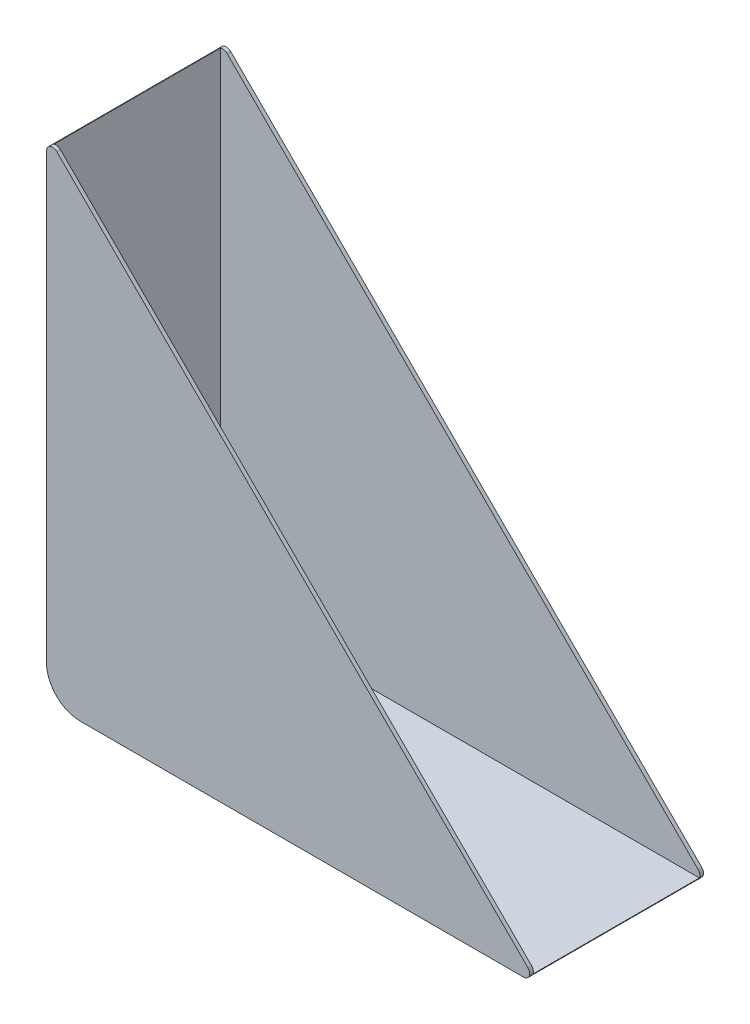
ISO-10303-21;
HEADER;
FILE_DESCRIPTION(('STEP AP214'),'2;1');
FILE_NAME('part.step','',(''),(''),'','','');
FILE_SCHEMA(('AUTOMOTIVE_DESIGN { 1 0 10303 214 1 1 1 1 }'));
ENDSEC;
DATA;
#1=APPLICATION_CONTEXT('core data for automotive mechanical design processes');
#2=APPLICATION_PROTOCOL_DEFINITION('international standard','automotive_design',2000,#1);
#3=PRODUCT_CONTEXT('',#1,'mechanical');
#4=PRODUCT('Part','Part','',(#3));
#5=PRODUCT_RELATED_PRODUCT_CATEGORY('part','',(#4));
#6=PRODUCT_DEFINITION_FORMATION('','',#4);
#7=PRODUCT_DEFINITION_CONTEXT('part definition',#1,'design');
#8=PRODUCT_DEFINITION('design','',#6,#7);
#9=PRODUCT_DEFINITION_SHAPE('','',#8);
#10=(LENGTH_UNIT() NAMED_UNIT(*) SI_UNIT(.MILLI.,.METRE.));
#11=(NAMED_UNIT(*) PLANE_ANGLE_UNIT() SI_UNIT($,.RADIAN.));
#12=(NAMED_UNIT(*) SI_UNIT($,.STERADIAN.) SOLID_ANGLE_UNIT());
#13=UNCERTAINTY_MEASURE_WITH_UNIT(LENGTH_MEASURE(1.E-05),#10,'distance_accuracy_value','');
#14=(GEOMETRIC_REPRESENTATION_CONTEXT(3) GLOBAL_UNCERTAINTY_ASSIGNED_CONTEXT((#13)) GLOBAL_UNIT_ASSIGNED_CONTEXT((#10,
#11,#12)) REPRESENTATION_CONTEXT('',''));
#15=CARTESIAN_POINT('',(0.,0.,0.));
#16=DIRECTION('',(0.,0.,1.));
#17=DIRECTION('',(1.,0.,0.));
#18=AXIS2_PLACEMENT_3D('',#15,#16,#17);
#19=CARTESIAN_POINT('',(0.,160.,27.5));
#20=DIRECTION('',(-0.707106781186548,-0.707106781186548,0.));
#21=DIRECTION('',(0.707106781186548,-0.707106781186548,0.));
#22=AXIS2_PLACEMENT_3D('',#19,#20,#21);
#23=PLANE('',#22);
#24=DIRECTION('',(-0.707106781186548,0.707106781186548,0.));
#25=VECTOR('',#24,1.);
#26=CARTESIAN_POINT('',(80.,80.,28.7));
#27=LINE('',#26,#25);
#28=CARTESIAN_POINT('',(157.785786437627,2.2142135623731,28.7));
#29=VERTEX_POINT('',#28);
#30=CARTESIAN_POINT('',(2.21421356237307,157.785786437627,28.7));
#31=VERTEX_POINT('',#30);
#32=EDGE_CURVE('E166',#29,#31,#27,.T.);
#33=ORIENTED_EDGE('',*,*,#32,.F.);
#34=DIRECTION('',(0.,0.,-1.));
#35=VECTOR('',#34,1.);
#36=CARTESIAN_POINT('',(157.785786437627,2.21421356237314,27.5));
#37=LINE('',#36,#35);
#38=CARTESIAN_POINT('',(157.785786437627,2.21421356237314,27.5));
#39=VERTEX_POINT('',#38);
#40=EDGE_CURVE('E193',#29,#39,#37,.T.);
#41=ORIENTED_EDGE('',*,*,#40,.T.);
#42=DIRECTION('',(-0.707106781186548,0.707106781186548,0.));
#43=VECTOR('',#42,1.);
#44=CARTESIAN_POINT('',(0.,160.,27.5));
#45=LINE('',#44,#43);
#46=CARTESIAN_POINT('',(2.21421356237309,157.785786437627,27.5));
#47=VERTEX_POINT('',#46);
#48=EDGE_CURVE('E240',#39,#47,#45,.T.);
#49=ORIENTED_EDGE('',*,*,#48,.T.);
#50=DIRECTION('',(0.,0.,-1.));
#51=VECTOR('',#50,1.);
#52=CARTESIAN_POINT('',(2.21421356237309,157.785786437627,27.5));
#53=LINE('',#52,#51);
#54=EDGE_CURVE('E178',#47,#31,#53,.F.);
#55=ORIENTED_EDGE('',*,*,#54,.T.);
#56=EDGE_LOOP('',(#33,#41,#49,#55));
#57=FACE_BOUND('',#56,.T.);
#58=ADVANCED_FACE('F35',(#57),#23,.F.);
#59=DIRECTION('',(-0.707106781186548,0.707106781186548,0.));
#60=VECTOR('',#59,1.);
#61=CARTESIAN_POINT('',(0.,160.,-27.5));
#62=LINE('',#61,#60);
#63=CARTESIAN_POINT('',(157.785786437627,2.21421356237308,-27.5));
#64=VERTEX_POINT('',#63);
#65=CARTESIAN_POINT('',(2.21421356237309,157.785786437627,-27.5));
#66=VERTEX_POINT('',#65);
#67=EDGE_CURVE('E152',#64,#66,#62,.T.);
#68=ORIENTED_EDGE('',*,*,#67,.F.);
#69=DIRECTION('',(0.,0.,-1.));
#70=VECTOR('',#69,1.);
#71=CARTESIAN_POINT('',(157.785786437627,2.21421356237314,27.5));
#72=LINE('',#71,#70);
#73=CARTESIAN_POINT('',(157.785786437627,2.2142135623731,-28.7));
#74=VERTEX_POINT('',#73);
#75=EDGE_CURVE('E191',#64,#74,#72,.T.);
#76=ORIENTED_EDGE('',*,*,#75,.T.);
#77=DIRECTION('',(-0.707106781186548,0.707106781186548,0.));
#78=VECTOR('',#77,1.);
#79=CARTESIAN_POINT('',(80.,80.,-28.7));
#80=LINE('',#79,#78);
#81=CARTESIAN_POINT('',(2.21421356237307,157.785786437627,-28.7));
#82=VERTEX_POINT('',#81);
#83=EDGE_CURVE('E174',#74,#82,#80,.T.);
#84=ORIENTED_EDGE('',*,*,#83,.T.);
#85=DIRECTION('',(0.,0.,-1.));
#86=VECTOR('',#85,1.);
#87=CARTESIAN_POINT('',(2.21421356237309,157.785786437627,27.5));
#88=LINE('',#87,#86);
#89=EDGE_CURVE('E189',#82,#66,#88,.F.);
#90=ORIENTED_EDGE('',*,*,#89,.T.);
#91=EDGE_LOOP('',(#68,#76,#84,#90));
#92=FACE_BOUND('',#91,.T.);
#93=ADVANCED_FACE('F251',(#92),#23,.F.);
#94=CARTESIAN_POINT('',(160.,-1.19999999999999,27.5));
#95=DIRECTION('',(0.,1.,0.));
#96=DIRECTION('',(-1.,0.,0.));
#97=AXIS2_PLACEMENT_3D('',#94,#95,#96);
#98=PLANE('',#97);
#99=DIRECTION('',(1.,0.,0.));
#100=VECTOR('',#99,1.);
#101=CARTESIAN_POINT('',(0.,-1.2,-28.7));
#102=LINE('',#101,#100);
#103=CARTESIAN_POINT('',(10.,-1.2,-28.7));
#104=VERTEX_POINT('',#103);
#105=CARTESIAN_POINT('',(156.371572875254,-1.19999999999999,-28.7));
#106=VERTEX_POINT('',#105);
#107=EDGE_CURVE('E163',#104,#106,#102,.T.);
#108=ORIENTED_EDGE('',*,*,#107,.T.);
#109=DIRECTION('',(0.,0.,-1.));
#110=VECTOR('',#109,1.);
#111=CARTESIAN_POINT('',(156.371572875254,-1.19999999999999,27.5));
#112=LINE('',#111,#110);
#113=CARTESIAN_POINT('',(156.371572875254,-1.19999999999999,28.7));
#114=VERTEX_POINT('',#113);
#115=EDGE_CURVE('E58',#106,#114,#112,.F.);
#116=ORIENTED_EDGE('',*,*,#115,.T.);
#117=DIRECTION('',(1.,0.,0.));
#118=VECTOR('',#117,1.);
#119=CARTESIAN_POINT('',(0.,-1.2,28.7));
#120=LINE('',#119,#118);
#121=CARTESIAN_POINT('',(10.,-1.2,28.7));
#122=VERTEX_POINT('',#121);
#123=EDGE_CURVE('E164',#122,#114,#120,.T.);
#124=ORIENTED_EDGE('',*,*,#123,.F.);
#125=DIRECTION('',(0.,0.,1.));
#126=VECTOR('',#125,1.);
#127=CARTESIAN_POINT('',(10.,-1.2,27.5));
#128=LINE('',#127,#126);
#129=EDGE_CURVE('E168',#122,#104,#128,.F.);
#130=ORIENTED_EDGE('',*,*,#129,.T.);
#131=EDGE_LOOP('',(#108,#116,#124,#130));
#132=FACE_BOUND('',#131,.T.);
#133=ADVANCED_FACE('F229',(#132),#98,.F.);
#134=CARTESIAN_POINT('',(-1.2,0.,27.5));
#135=DIRECTION('',(1.,0.,0.));
#136=DIRECTION('',(0.,0.,-1.));
#137=AXIS2_PLACEMENT_3D('',#134,#135,#136);
#138=PLANE('',#137);
#139=DIRECTION('',(0.,-1.,0.));
#140=VECTOR('',#139,1.);
#141=CARTESIAN_POINT('',(-1.2,0.,28.7));
#142=LINE('',#141,#140);
#143=CARTESIAN_POINT('',(-1.2,156.371572875254,28.7));
#144=VERTEX_POINT('',#143);
#145=CARTESIAN_POINT('',(-1.2,10.,28.7));
#146=VERTEX_POINT('',#145);
#147=EDGE_CURVE('E172',#144,#146,#142,.T.);
#148=ORIENTED_EDGE('',*,*,#147,.F.);
#149=DIRECTION('',(0.,0.,-1.));
#150=VECTOR('',#149,1.);
#151=CARTESIAN_POINT('',(-1.2,156.371572875254,27.5));
#152=LINE('',#151,#150);
#153=CARTESIAN_POINT('',(-1.2,156.371572875254,-28.7));
#154=VERTEX_POINT('',#153);
#155=EDGE_CURVE('E43',#144,#154,#152,.T.);
#156=ORIENTED_EDGE('',*,*,#155,.T.);
#157=DIRECTION('',(0.,-1.,0.));
#158=VECTOR('',#157,1.);
#159=CARTESIAN_POINT('',(-1.2,0.,-28.7));
#160=LINE('',#159,#158);
#161=CARTESIAN_POINT('',(-1.2,10.,-28.7));
#162=VERTEX_POINT('',#161);
#163=EDGE_CURVE('E167',#154,#162,#160,.T.);
#164=ORIENTED_EDGE('',*,*,#163,.T.);
#165=DIRECTION('',(0.,0.,-1.));
#166=VECTOR('',#165,1.);
#167=CARTESIAN_POINT('',(-1.2,10.,27.5));
#168=LINE('',#167,#166);
#169=EDGE_CURVE('E179',#162,#146,#168,.F.);
#170=ORIENTED_EDGE('',*,*,#169,.T.);
#171=EDGE_LOOP('',(#148,#156,#164,#170));
#172=FACE_BOUND('',#171,.T.);
#173=ADVANCED_FACE('F216',(#172),#138,.F.);
#174=CARTESIAN_POINT('',(0.,0.,28.7));
#175=DIRECTION('',(0.,0.,-1.));
#176=DIRECTION('',(-1.,0.,0.));
#177=AXIS2_PLACEMENT_3D('',#174,#175,#176);
#178=PLANE('',#177);
#179=ORIENTED_EDGE('',*,*,#123,.T.);
#180=CARTESIAN_POINT('',(156.371572875254,0.800000000000023,28.7));
#181=DIRECTION('',(0.,0.,-1.));
#182=DIRECTION('',(-1.,0.,0.));
#183=AXIS2_PLACEMENT_3D('',#180,#181,#182);
#184=CIRCLE('',#183,2.);
#185=EDGE_CURVE('E211',#114,#29,#184,.F.);
#186=ORIENTED_EDGE('',*,*,#185,.T.);
#187=ORIENTED_EDGE('',*,*,#32,.T.);
#188=CARTESIAN_POINT('',(0.8,156.371572875254,28.7));
#189=DIRECTION('',(0.,0.,-1.));
#190=DIRECTION('',(-1.,0.,0.));
#191=AXIS2_PLACEMENT_3D('',#188,#189,#190);
#192=CIRCLE('',#191,2.);
#193=EDGE_CURVE('E50',#31,#144,#192,.F.);
#194=ORIENTED_EDGE('',*,*,#193,.T.);
#195=ORIENTED_EDGE('',*,*,#147,.T.);
#196=CARTESIAN_POINT('',(10.,10.,28.7));
#197=DIRECTION('',(0.,0.,-1.));
#198=DIRECTION('',(-1.,0.,0.));
#199=AXIS2_PLACEMENT_3D('',#196,#197,#198);
#200=CIRCLE('',#199,11.2);
#201=EDGE_CURVE('E176',#146,#122,#200,.F.);
#202=ORIENTED_EDGE('',*,*,#201,.T.);
#203=EDGE_LOOP('',(#179,#186,#187,#194,#195,#202));
#204=FACE_BOUND('',#203,.T.);
#205=ADVANCED_FACE('F227',(#204),#178,.F.);
#206=CARTESIAN_POINT('',(0.,0.,-28.7));
#207=DIRECTION('',(0.,0.,-1.));
#208=DIRECTION('',(-1.,0.,0.));
#209=AXIS2_PLACEMENT_3D('',#206,#207,#208);
#210=PLANE('',#209);
#211=ORIENTED_EDGE('',*,*,#83,.F.);
#212=CARTESIAN_POINT('',(156.371572875254,0.800000000000023,-28.7));
#213=DIRECTION('',(0.,0.,-1.));
#214=DIRECTION('',(-1.,0.,0.));
#215=AXIS2_PLACEMENT_3D('',#212,#213,#214);
#216=CIRCLE('',#215,2.);
#217=EDGE_CURVE('E207',#74,#106,#216,.T.);
#218=ORIENTED_EDGE('',*,*,#217,.T.);
#219=ORIENTED_EDGE('',*,*,#107,.F.);
#220=CARTESIAN_POINT('',(10.,10.,-28.7));
#221=DIRECTION('',(0.,0.,-1.));
#222=DIRECTION('',(-1.,0.,0.));
#223=AXIS2_PLACEMENT_3D('',#220,#221,#222);
#224=CIRCLE('',#223,11.2);
#225=EDGE_CURVE('E171',#104,#162,#224,.T.);
#226=ORIENTED_EDGE('',*,*,#225,.T.);
#227=ORIENTED_EDGE('',*,*,#163,.F.);
#228=CARTESIAN_POINT('',(0.8,156.371572875254,-28.7));
#229=DIRECTION('',(0.,0.,-1.));
#230=DIRECTION('',(-1.,0.,0.));
#231=AXIS2_PLACEMENT_3D('',#228,#229,#230);
#232=CIRCLE('',#231,2.);
#233=EDGE_CURVE('E205',#154,#82,#232,.T.);
#234=ORIENTED_EDGE('',*,*,#233,.T.);
#235=EDGE_LOOP('',(#211,#218,#219,#226,#227,#234));
#236=FACE_BOUND('',#235,.T.);
#237=ADVANCED_FACE('F220',(#236),#210,.T.);
#238=CARTESIAN_POINT('',(10.,10.,27.5));
#239=DIRECTION('',(0.,0.,-1.));
#240=DIRECTION('',(-1.,0.,0.));
#241=AXIS2_PLACEMENT_3D('',#238,#239,#240);
#242=CYLINDRICAL_SURFACE('',#241,11.2);
#243=ORIENTED_EDGE('',*,*,#201,.F.);
#244=ORIENTED_EDGE('',*,*,#169,.F.);
#245=ORIENTED_EDGE('',*,*,#225,.F.);
#246=ORIENTED_EDGE('',*,*,#129,.F.);
#247=EDGE_LOOP('',(#243,#244,#245,#246));
#248=FACE_BOUND('',#247,.T.);
#249=ADVANCED_FACE('F226',(#248),#242,.T.);
#250=CARTESIAN_POINT('',(160.,0.,27.5));
#251=DIRECTION('',(0.,1.,0.));
#252=DIRECTION('',(-1.,0.,0.));
#253=AXIS2_PLACEMENT_3D('',#250,#251,#252);
#254=PLANE('',#253);
#255=DIRECTION('',(1.,0.,0.));
#256=VECTOR('',#255,1.);
#257=CARTESIAN_POINT('',(160.,0.,27.5));
#258=LINE('',#257,#256);
#259=CARTESIAN_POINT('',(10.,0.,27.5));
#260=VERTEX_POINT('',#259);
#261=CARTESIAN_POINT('',(158.204603153236,0.,27.5));
#262=VERTEX_POINT('',#261);
#263=EDGE_CURVE('E159',#260,#262,#258,.T.);
#264=ORIENTED_EDGE('',*,*,#263,.T.);
#265=DIRECTION('',(0.,0.,-1.));
#266=VECTOR('',#265,1.);
#267=CARTESIAN_POINT('',(158.204603153236,0.,27.5));
#268=LINE('',#267,#266);
#269=CARTESIAN_POINT('',(158.204603153236,0.,-27.5));
#270=VERTEX_POINT('',#269);
#271=EDGE_CURVE('E151',#262,#270,#268,.T.);
#272=ORIENTED_EDGE('',*,*,#271,.T.);
#273=DIRECTION('',(1.,0.,0.));
#274=VECTOR('',#273,1.);
#275=CARTESIAN_POINT('',(160.,0.,-27.5));
#276=LINE('',#275,#274);
#277=CARTESIAN_POINT('',(10.,0.,-27.5));
#278=VERTEX_POINT('',#277);
#279=EDGE_CURVE('E130',#278,#270,#276,.T.);
#280=ORIENTED_EDGE('',*,*,#279,.F.);
#281=DIRECTION('',(0.,0.,-1.));
#282=VECTOR('',#281,1.);
#283=CARTESIAN_POINT('',(10.,0.,27.5));
#284=LINE('',#283,#282);
#285=EDGE_CURVE('E138',#260,#278,#284,.T.);
#286=ORIENTED_EDGE('',*,*,#285,.F.);
#287=EDGE_LOOP('',(#264,#272,#280,#286));
#288=FACE_BOUND('',#287,.T.);
#289=ADVANCED_FACE('F149',(#288),#254,.T.);
#290=CARTESIAN_POINT('',(0.,0.,27.5));
#291=DIRECTION('',(1.,0.,0.));
#292=DIRECTION('',(0.,0.,-1.));
#293=AXIS2_PLACEMENT_3D('',#290,#291,#292);
#294=PLANE('',#293);
#295=DIRECTION('',(0.,-1.,0.));
#296=VECTOR('',#295,1.);
#297=CARTESIAN_POINT('',(0.,0.,-27.5));
#298=LINE('',#297,#296);
#299=CARTESIAN_POINT('',(0.,158.204603153236,-27.5));
#300=VERTEX_POINT('',#299);
#301=CARTESIAN_POINT('',(0.,10.,-27.5));
#302=VERTEX_POINT('',#301);
#303=EDGE_CURVE('E133',#300,#302,#298,.T.);
#304=ORIENTED_EDGE('',*,*,#303,.F.);
#305=DIRECTION('',(0.,0.,-1.));
#306=VECTOR('',#305,1.);
#307=CARTESIAN_POINT('',(0.,158.204603153236,-27.5));
#308=LINE('',#307,#306);
#309=CARTESIAN_POINT('',(0.,158.204603153236,27.5));
#310=VERTEX_POINT('',#309);
#311=EDGE_CURVE('E11',#300,#310,#308,.F.);
#312=ORIENTED_EDGE('',*,*,#311,.T.);
#313=DIRECTION('',(0.,-1.,0.));
#314=VECTOR('',#313,1.);
#315=CARTESIAN_POINT('',(0.,0.,27.5));
#316=LINE('',#315,#314);
#317=CARTESIAN_POINT('',(0.,10.,27.5));
#318=VERTEX_POINT('',#317);
#319=EDGE_CURVE('E147',#310,#318,#316,.T.);
#320=ORIENTED_EDGE('',*,*,#319,.T.);
#321=DIRECTION('',(0.,0.,-1.));
#322=VECTOR('',#321,1.);
#323=CARTESIAN_POINT('',(0.,10.,27.5));
#324=LINE('',#323,#322);
#325=EDGE_CURVE('E137',#302,#318,#324,.F.);
#326=ORIENTED_EDGE('',*,*,#325,.F.);
#327=EDGE_LOOP('',(#304,#312,#320,#326));
#328=FACE_BOUND('',#327,.T.);
#329=ADVANCED_FACE('F253',(#328),#294,.T.);
#330=CARTESIAN_POINT('',(0.,0.,27.5));
#331=DIRECTION('',(0.,0.,-1.));
#332=DIRECTION('',(-1.,0.,0.));
#333=AXIS2_PLACEMENT_3D('',#330,#331,#332);
#334=PLANE('',#333);
#335=ORIENTED_EDGE('',*,*,#48,.F.);
#336=CARTESIAN_POINT('',(156.371572875254,0.800000000000023,27.5));
#337=DIRECTION('',(0.,0.,-1.));
#338=DIRECTION('',(-1.,0.,0.));
#339=AXIS2_PLACEMENT_3D('',#336,#337,#338);
#340=CIRCLE('',#339,2.);
#341=EDGE_CURVE('E198',#39,#262,#340,.T.);
#342=ORIENTED_EDGE('',*,*,#341,.T.);
#343=ORIENTED_EDGE('',*,*,#263,.F.);
#344=CARTESIAN_POINT('',(10.,10.,27.5));
#345=DIRECTION('',(0.,0.,-1.));
#346=DIRECTION('',(-1.,0.,0.));
#347=AXIS2_PLACEMENT_3D('',#344,#345,#346);
#348=CIRCLE('',#347,10.);
#349=EDGE_CURVE('E143',#318,#260,#348,.F.);
#350=ORIENTED_EDGE('',*,*,#349,.F.);
#351=ORIENTED_EDGE('',*,*,#319,.F.);
#352=CARTESIAN_POINT('',(0.8,156.371572875254,27.5));
#353=DIRECTION('',(0.,0.,-1.));
#354=DIRECTION('',(-1.,0.,0.));
#355=AXIS2_PLACEMENT_3D('',#352,#353,#354);
#356=CIRCLE('',#355,2.);
#357=EDGE_CURVE('E196',#310,#47,#356,.T.);
#358=ORIENTED_EDGE('',*,*,#357,.T.);
#359=EDGE_LOOP('',(#335,#342,#343,#350,#351,#358));
#360=FACE_BOUND('',#359,.T.);
#361=ADVANCED_FACE('F246',(#360),#334,.T.);
#362=CARTESIAN_POINT('',(0.,0.,-27.5));
#363=DIRECTION('',(0.,0.,-1.));
#364=DIRECTION('',(-1.,0.,0.));
#365=AXIS2_PLACEMENT_3D('',#362,#363,#364);
#366=PLANE('',#365);
#367=ORIENTED_EDGE('',*,*,#279,.T.);
#368=CARTESIAN_POINT('',(156.371572875254,0.800000000000023,-27.5));
#369=DIRECTION('',(0.,0.,-1.));
#370=DIRECTION('',(-1.,0.,0.));
#371=AXIS2_PLACEMENT_3D('',#368,#369,#370);
#372=CIRCLE('',#371,2.);
#373=EDGE_CURVE('E203',#270,#64,#372,.F.);
#374=ORIENTED_EDGE('',*,*,#373,.T.);
#375=ORIENTED_EDGE('',*,*,#67,.T.);
#376=CARTESIAN_POINT('',(0.8,156.371572875254,-27.5));
#377=DIRECTION('',(0.,0.,-1.));
#378=DIRECTION('',(-1.,0.,0.));
#379=AXIS2_PLACEMENT_3D('',#376,#377,#378);
#380=CIRCLE('',#379,2.);
#381=EDGE_CURVE('E201',#66,#300,#380,.F.);
#382=ORIENTED_EDGE('',*,*,#381,.T.);
#383=ORIENTED_EDGE('',*,*,#303,.T.);
#384=CARTESIAN_POINT('',(10.,10.,-27.5));
#385=DIRECTION('',(0.,0.,-1.));
#386=DIRECTION('',(-1.,0.,0.));
#387=AXIS2_PLACEMENT_3D('',#384,#385,#386);
#388=CIRCLE('',#387,10.);
#389=EDGE_CURVE('E126',#278,#302,#388,.T.);
#390=ORIENTED_EDGE('',*,*,#389,.F.);
#391=EDGE_LOOP('',(#367,#374,#375,#382,#383,#390));
#392=FACE_BOUND('',#391,.T.);
#393=ADVANCED_FACE('F128',(#392),#366,.F.);
#394=CARTESIAN_POINT('',(10.,10.,27.5));
#395=DIRECTION('',(0.,0.,-1.));
#396=DIRECTION('',(-1.,0.,0.));
#397=AXIS2_PLACEMENT_3D('',#394,#395,#396);
#398=CYLINDRICAL_SURFACE('',#397,10.);
#399=ORIENTED_EDGE('',*,*,#349,.T.);
#400=ORIENTED_EDGE('',*,*,#285,.T.);
#401=ORIENTED_EDGE('',*,*,#389,.T.);
#402=ORIENTED_EDGE('',*,*,#325,.T.);
#403=EDGE_LOOP('',(#399,#400,#401,#402));
#404=FACE_BOUND('',#403,.T.);
#405=ADVANCED_FACE('F141',(#404),#398,.F.);
#406=CARTESIAN_POINT('',(156.371572875254,0.800000000000023,27.5));
#407=DIRECTION('',(0.,0.,-1.));
#408=DIRECTION('',(-1.,0.,0.));
#409=AXIS2_PLACEMENT_3D('',#406,#407,#408);
#410=CYLINDRICAL_SURFACE('',#409,2.);
#411=ORIENTED_EDGE('',*,*,#185,.F.);
#412=ORIENTED_EDGE('',*,*,#115,.F.);
#413=ORIENTED_EDGE('',*,*,#217,.F.);
#414=ORIENTED_EDGE('',*,*,#75,.F.);
#415=ORIENTED_EDGE('',*,*,#373,.F.);
#416=ORIENTED_EDGE('',*,*,#271,.F.);
#417=ORIENTED_EDGE('',*,*,#341,.F.);
#418=ORIENTED_EDGE('',*,*,#40,.F.);
#419=EDGE_LOOP('',(#411,#412,#413,#414,#415,#416,#417,#418));
#420=FACE_BOUND('',#419,.T.);
#421=ADVANCED_FACE('F232',(#420),#410,.T.);
#422=CARTESIAN_POINT('',(0.8,156.371572875254,27.5));
#423=DIRECTION('',(0.,0.,-1.));
#424=DIRECTION('',(-1.,0.,0.));
#425=AXIS2_PLACEMENT_3D('',#422,#423,#424);
#426=CYLINDRICAL_SURFACE('',#425,2.);
#427=ORIENTED_EDGE('',*,*,#381,.F.);
#428=ORIENTED_EDGE('',*,*,#89,.F.);
#429=ORIENTED_EDGE('',*,*,#233,.F.);
#430=ORIENTED_EDGE('',*,*,#155,.F.);
#431=ORIENTED_EDGE('',*,*,#193,.F.);
#432=ORIENTED_EDGE('',*,*,#54,.F.);
#433=ORIENTED_EDGE('',*,*,#357,.F.);
#434=ORIENTED_EDGE('',*,*,#311,.F.);
#435=EDGE_LOOP('',(#427,#428,#429,#430,#431,#432,#433,#434));
#436=FACE_BOUND('',#435,.T.);
#437=ADVANCED_FACE('F37',(#436),#426,.T.);
#438=CLOSED_SHELL('',(#58,#93,#133,#173,#205,#237,#249,#289,#329,#361,#393,#405,#421,#437));
#439=MANIFOLD_SOLID_BREP('B2',#438);
#440=ADVANCED_BREP_SHAPE_REPRESENTATION('',(#18,#439),#14);
#441=SHAPE_DEFINITION_REPRESENTATION(#9,#440);
ENDSEC;
END-ISO-10303-21;
